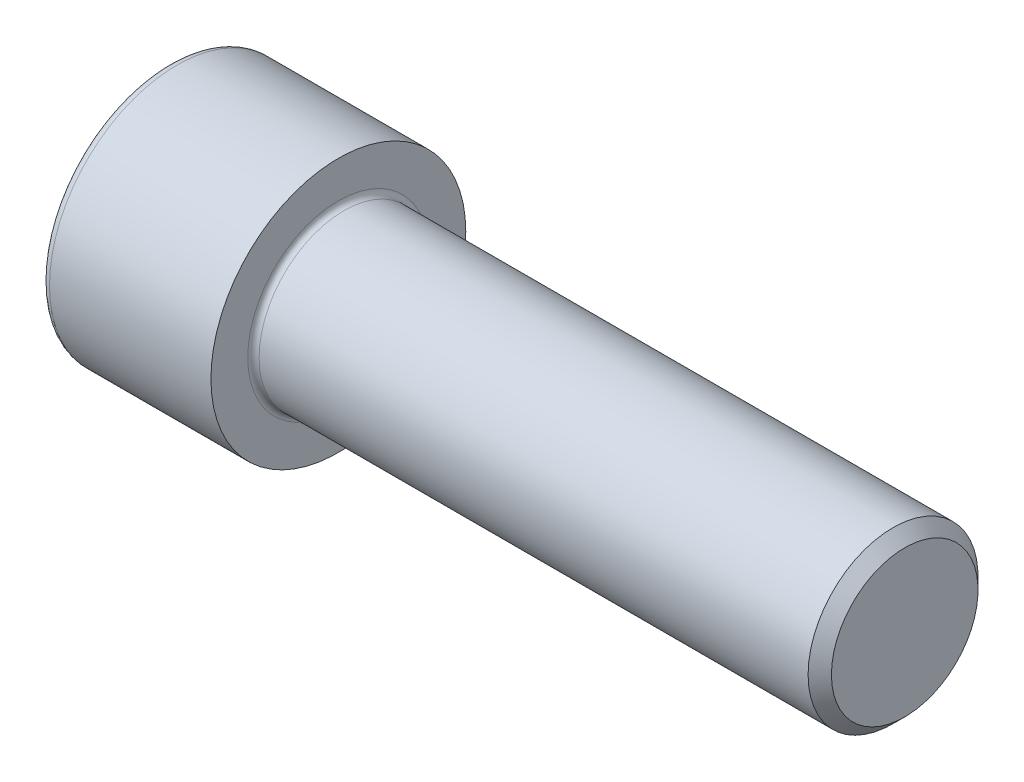
ISO-10303-21;
HEADER;
FILE_DESCRIPTION(('STEP AP214'),'2;1');
FILE_NAME('part.step','',(''),(''),'','','');
FILE_SCHEMA(('AUTOMOTIVE_DESIGN { 1 0 10303 214 1 1 1 1 }'));
ENDSEC;
DATA;
#1=APPLICATION_CONTEXT('core data for automotive mechanical design processes');
#2=APPLICATION_PROTOCOL_DEFINITION('international standard','automotive_design',2000,#1);
#3=PRODUCT_CONTEXT('',#1,'mechanical');
#4=PRODUCT('Part','Part','',(#3));
#5=PRODUCT_RELATED_PRODUCT_CATEGORY('part','',(#4));
#6=PRODUCT_DEFINITION_FORMATION('','',#4);
#7=PRODUCT_DEFINITION_CONTEXT('part definition',#1,'design');
#8=PRODUCT_DEFINITION('design','',#6,#7);
#9=PRODUCT_DEFINITION_SHAPE('','',#8);
#10=(LENGTH_UNIT() NAMED_UNIT(*) SI_UNIT(.MILLI.,.METRE.));
#11=(NAMED_UNIT(*) PLANE_ANGLE_UNIT() SI_UNIT($,.RADIAN.));
#12=(NAMED_UNIT(*) SI_UNIT($,.STERADIAN.) SOLID_ANGLE_UNIT());
#13=UNCERTAINTY_MEASURE_WITH_UNIT(LENGTH_MEASURE(1.E-05),#10,'distance_accuracy_value','');
#14=(GEOMETRIC_REPRESENTATION_CONTEXT(3) GLOBAL_UNCERTAINTY_ASSIGNED_CONTEXT((#13)) GLOBAL_UNIT_ASSIGNED_CONTEXT((#10,
#11,#12)) REPRESENTATION_CONTEXT('',''));
#15=CARTESIAN_POINT('',(0.,0.,0.));
#16=DIRECTION('',(0.,0.,1.));
#17=DIRECTION('',(1.,0.,0.));
#18=AXIS2_PLACEMENT_3D('',#15,#16,#17);
#19=CARTESIAN_POINT('',(0.,0.,0.));
#20=DIRECTION('',(-1.,0.,0.));
#21=DIRECTION('',(0.,0.,1.));
#22=AXIS2_PLACEMENT_3D('',#19,#20,#21);
#23=PLANE('',#22);
#24=DIRECTION('',(0.,-0.499999999999999,0.866025403784439));
#25=VECTOR('',#24,1.);
#26=CARTESIAN_POINT('',(0.,11.12842643863,0.));
#27=LINE('',#26,#25);
#28=CARTESIAN_POINT('',(0.,11.12842643863,0.));
#29=VERTEX_POINT('',#28);
#30=CARTESIAN_POINT('',(0.,5.56421321931503,9.63749999999999));
#31=VERTEX_POINT('',#30);
#32=EDGE_CURVE('E265',#29,#31,#27,.T.);
#33=ORIENTED_EDGE('',*,*,#32,.T.);
#34=DIRECTION('',(0.,1.,0.));
#35=VECTOR('',#34,1.);
#36=CARTESIAN_POINT('',(0.,-5.564213219315,9.6375));
#37=LINE('',#36,#35);
#38=CARTESIAN_POINT('',(0.,-5.564213219315,9.6375));
#39=VERTEX_POINT('',#38);
#40=EDGE_CURVE('E126',#39,#31,#37,.T.);
#41=ORIENTED_EDGE('',*,*,#40,.F.);
#42=DIRECTION('',(0.,-0.500000000000001,-0.866025403784438));
#43=VECTOR('',#42,1.);
#44=CARTESIAN_POINT('',(0.,-5.564213219315,9.6375));
#45=LINE('',#44,#43);
#46=CARTESIAN_POINT('',(0.,-11.12842643863,0.));
#47=VERTEX_POINT('',#46);
#48=EDGE_CURVE('E268',#39,#47,#45,.T.);
#49=ORIENTED_EDGE('',*,*,#48,.T.);
#50=DIRECTION('',(0.,0.499999999999999,-0.866025403784439));
#51=VECTOR('',#50,1.);
#52=CARTESIAN_POINT('',(0.,-11.12842643863,0.));
#53=LINE('',#52,#51);
#54=CARTESIAN_POINT('',(0.,-5.56421321931503,-9.63749999999999));
#55=VERTEX_POINT('',#54);
#56=EDGE_CURVE('E271',#47,#55,#53,.T.);
#57=ORIENTED_EDGE('',*,*,#56,.T.);
#58=DIRECTION('',(0.,-1.,0.));
#59=VECTOR('',#58,1.);
#60=CARTESIAN_POINT('',(0.,5.564213219315,-9.63750000000001));
#61=LINE('',#60,#59);
#62=CARTESIAN_POINT('',(0.,5.564213219315,-9.63750000000001));
#63=VERTEX_POINT('',#62);
#64=EDGE_CURVE('E274',#63,#55,#61,.T.);
#65=ORIENTED_EDGE('',*,*,#64,.F.);
#66=DIRECTION('',(0.,-0.500000000000001,-0.866025403784438));
#67=VECTOR('',#66,1.);
#68=CARTESIAN_POINT('',(0.,11.12842643863,0.));
#69=LINE('',#68,#67);
#70=EDGE_CURVE('E121',#29,#63,#69,.T.);
#71=ORIENTED_EDGE('',*,*,#70,.F.);
#72=EDGE_LOOP('',(#33,#41,#49,#57,#65,#71));
#73=FACE_BOUND('',#72,.T.);
#74=CARTESIAN_POINT('',(0.,0.,0.));
#75=DIRECTION('',(-1.,0.,0.));
#76=DIRECTION('',(0.,0.,1.));
#77=AXIS2_PLACEMENT_3D('',#74,#75,#76);
#78=CIRCLE('',#77,16.8);
#79=CARTESIAN_POINT('',(0.,0.,16.8));
#80=VERTEX_POINT('',#79);
#81=EDGE_CURVE('E42',#80,#80,#78,.T.);
#82=ORIENTED_EDGE('',*,*,#81,.T.);
#83=EDGE_LOOP('',(#82));
#84=FACE_BOUND('',#83,.T.);
#85=ADVANCED_FACE('F34',(#73,#84),#23,.T.);
#86=CARTESIAN_POINT('',(-31.75,0.,0.));
#87=DIRECTION('',(-1.,0.,0.));
#88=DIRECTION('',(0.,0.,1.));
#89=AXIS2_PLACEMENT_3D('',#86,#87,#88);
#90=CYLINDRICAL_SURFACE('',#89,18.);
#91=CARTESIAN_POINT('',(1.2,0.,0.));
#92=DIRECTION('',(-1.,0.,0.));
#93=DIRECTION('',(0.,0.,1.));
#94=AXIS2_PLACEMENT_3D('',#91,#92,#93);
#95=CIRCLE('',#94,18.);
#96=CARTESIAN_POINT('',(1.2,0.,18.));
#97=VERTEX_POINT('',#96);
#98=EDGE_CURVE('E11',#97,#97,#95,.F.);
#99=ORIENTED_EDGE('',*,*,#98,.T.);
#100=EDGE_LOOP('',(#99));
#101=FACE_BOUND('',#100,.T.);
#102=CARTESIAN_POINT('',(24.,0.,0.));
#103=DIRECTION('',(-1.,0.,0.));
#104=DIRECTION('',(0.,0.,1.));
#105=AXIS2_PLACEMENT_3D('',#102,#103,#104);
#106=CIRCLE('',#105,18.);
#107=CARTESIAN_POINT('',(24.,0.,18.));
#108=VERTEX_POINT('',#107);
#109=EDGE_CURVE('E144',#108,#108,#106,.T.);
#110=ORIENTED_EDGE('',*,*,#109,.T.);
#111=EDGE_LOOP('',(#110));
#112=FACE_BOUND('',#111,.T.);
#113=ADVANCED_FACE('F168',(#101,#112),#90,.T.);
#114=CARTESIAN_POINT('',(24.,18.,0.));
#115=DIRECTION('',(1.,0.,0.));
#116=DIRECTION('',(0.,0.,-1.));
#117=AXIS2_PLACEMENT_3D('',#114,#115,#116);
#118=PLANE('',#117);
#119=CARTESIAN_POINT('',(24.,0.,0.));
#120=DIRECTION('',(1.,0.,0.));
#121=DIRECTION('',(0.,0.,-1.));
#122=AXIS2_PLACEMENT_3D('',#119,#120,#121);
#123=CIRCLE('',#122,12.8);
#124=CARTESIAN_POINT('',(24.,0.,-12.8));
#125=VERTEX_POINT('',#124);
#126=EDGE_CURVE('E147',#125,#125,#123,.F.);
#127=ORIENTED_EDGE('',*,*,#126,.T.);
#128=EDGE_LOOP('',(#127));
#129=FACE_BOUND('',#128,.T.);
#130=ORIENTED_EDGE('',*,*,#109,.F.);
#131=EDGE_LOOP('',(#130));
#132=FACE_BOUND('',#131,.T.);
#133=ADVANCED_FACE('F174',(#129,#132),#118,.T.);
#134=CARTESIAN_POINT('',(-31.75,0.,0.));
#135=DIRECTION('',(-1.,0.,0.));
#136=DIRECTION('',(0.,0.,1.));
#137=AXIS2_PLACEMENT_3D('',#134,#135,#136);
#138=CYLINDRICAL_SURFACE('',#137,12.);
#139=CARTESIAN_POINT('',(24.8,0.,0.));
#140=DIRECTION('',(1.,0.,0.));
#141=DIRECTION('',(0.,0.,-1.));
#142=AXIS2_PLACEMENT_3D('',#139,#140,#141);
#143=CIRCLE('',#142,12.);
#144=CARTESIAN_POINT('',(24.8,0.,-12.));
#145=VERTEX_POINT('',#144);
#146=EDGE_CURVE('E150',#145,#145,#143,.T.);
#147=ORIENTED_EDGE('',*,*,#146,.T.);
#148=EDGE_LOOP('',(#147));
#149=FACE_BOUND('',#148,.T.);
#150=CARTESIAN_POINT('',(102.351999999998,0.,0.));
#151=DIRECTION('',(-1.,0.,0.));
#152=DIRECTION('',(0.,0.,1.));
#153=AXIS2_PLACEMENT_3D('',#150,#151,#152);
#154=CIRCLE('',#153,12.);
#155=CARTESIAN_POINT('',(102.351999999998,0.,12.));
#156=VERTEX_POINT('',#155);
#157=EDGE_CURVE('E141',#156,#156,#154,.T.);
#158=ORIENTED_EDGE('',*,*,#157,.T.);
#159=EDGE_LOOP('',(#158));
#160=FACE_BOUND('',#159,.T.);
#161=ADVANCED_FACE('F180',(#149,#160),#138,.T.);
#162=CARTESIAN_POINT('',(104.,0.,0.));
#163=DIRECTION('',(-1.,0.,0.));
#164=DIRECTION('',(0.,0.,1.));
#165=AXIS2_PLACEMENT_3D('',#162,#163,#164);
#166=CONICAL_SURFACE('',#165,10.352,0.785398163396898);
#167=ORIENTED_EDGE('',*,*,#157,.F.);
#168=EDGE_LOOP('',(#167));
#169=FACE_BOUND('',#168,.T.);
#170=CARTESIAN_POINT('',(104.,0.,0.));
#171=DIRECTION('',(-1.,0.,0.));
#172=DIRECTION('',(0.,0.,1.));
#173=AXIS2_PLACEMENT_3D('',#170,#171,#172);
#174=CIRCLE('',#173,10.352);
#175=CARTESIAN_POINT('',(104.,0.,10.352));
#176=VERTEX_POINT('',#175);
#177=EDGE_CURVE('E137',#176,#176,#174,.T.);
#178=ORIENTED_EDGE('',*,*,#177,.T.);
#179=EDGE_LOOP('',(#178));
#180=FACE_BOUND('',#179,.T.);
#181=ADVANCED_FACE('F184',(#169,#180),#166,.T.);
#182=CARTESIAN_POINT('',(104.,10.352,0.));
#183=DIRECTION('',(1.,0.,0.));
#184=DIRECTION('',(0.,0.,-1.));
#185=AXIS2_PLACEMENT_3D('',#182,#183,#184);
#186=PLANE('',#185);
#187=ORIENTED_EDGE('',*,*,#177,.F.);
#188=EDGE_LOOP('',(#187));
#189=FACE_BOUND('',#188,.T.);
#190=ADVANCED_FACE('F164',(#189),#186,.T.);
#191=CARTESIAN_POINT('',(24.8,0.,0.));
#192=DIRECTION('',(1.,0.,0.));
#193=DIRECTION('',(0.,0.,-1.));
#194=AXIS2_PLACEMENT_3D('',#191,#192,#193);
#195=TOROIDAL_SURFACE('',#194,12.8,0.8);
#196=ORIENTED_EDGE('',*,*,#146,.F.);
#197=EDGE_LOOP('',(#196));
#198=FACE_BOUND('',#197,.T.);
#199=ORIENTED_EDGE('',*,*,#126,.F.);
#200=EDGE_LOOP('',(#199));
#201=FACE_BOUND('',#200,.T.);
#202=ADVANCED_FACE('F157',(#198,#201),#195,.F.);
#203=CARTESIAN_POINT('',(1.2,0.,0.));
#204=DIRECTION('',(-1.,0.,0.));
#205=DIRECTION('',(0.,0.,1.));
#206=AXIS2_PLACEMENT_3D('',#203,#204,#205);
#207=TOROIDAL_SURFACE('',#206,16.8,1.2);
#208=ORIENTED_EDGE('',*,*,#98,.F.);
#209=EDGE_LOOP('',(#208));
#210=FACE_BOUND('',#209,.T.);
#211=ORIENTED_EDGE('',*,*,#81,.F.);
#212=EDGE_LOOP('',(#211));
#213=FACE_BOUND('',#212,.T.);
#214=ADVANCED_FACE('F36',(#210,#213),#207,.T.);
#215=CARTESIAN_POINT('',(12.573,11.12842643863,0.));
#216=DIRECTION('',(0.,-0.866025403784439,-0.499999999999999));
#217=DIRECTION('',(0.,0.499999999999999,-0.866025403784439));
#218=AXIS2_PLACEMENT_3D('',#215,#216,#217);
#219=PLANE('',#218);
#220=ORIENTED_EDGE('',*,*,#32,.F.);
#221=DIRECTION('',(-1.,0.,0.));
#222=VECTOR('',#221,1.);
#223=CARTESIAN_POINT('',(12.573,11.12842643863,0.));
#224=LINE('',#223,#222);
#225=CARTESIAN_POINT('',(12.573,11.12842643863,0.));
#226=VERTEX_POINT('',#225);
#227=EDGE_CURVE('E264',#226,#29,#224,.T.);
#228=ORIENTED_EDGE('',*,*,#227,.F.);
#229=DIRECTION('',(0.,-0.499999999999999,0.866025403784439));
#230=VECTOR('',#229,1.);
#231=CARTESIAN_POINT('',(12.573,11.12842643863,0.));
#232=LINE('',#231,#230);
#233=CARTESIAN_POINT('',(12.573,8.34631982897253,4.81874999999999));
#234=VERTEX_POINT('',#233);
#235=EDGE_CURVE('E49',#226,#234,#232,.T.);
#236=ORIENTED_EDGE('',*,*,#235,.T.);
#237=CARTESIAN_POINT('',(12.573,5.56421321931503,9.63749999999999));
#238=VERTEX_POINT('',#237);
#239=EDGE_CURVE('E107',#234,#238,#232,.T.);
#240=ORIENTED_EDGE('',*,*,#239,.T.);
#241=DIRECTION('',(-1.,0.,0.));
#242=VECTOR('',#241,1.);
#243=CARTESIAN_POINT('',(12.573,5.56421321931503,9.63749999999999));
#244=LINE('',#243,#242);
#245=EDGE_CURVE('E119',#238,#31,#244,.T.);
#246=ORIENTED_EDGE('',*,*,#245,.T.);
#247=EDGE_LOOP('',(#220,#228,#236,#240,#246));
#248=FACE_BOUND('',#247,.T.);
#249=ADVANCED_FACE('F118',(#248),#219,.T.);
#250=CARTESIAN_POINT('',(12.573,-5.564213219315,9.6375));
#251=DIRECTION('',(0.,0.,1.));
#252=DIRECTION('',(0.,-1.,0.));
#253=AXIS2_PLACEMENT_3D('',#250,#251,#252);
#254=PLANE('',#253);
#255=ORIENTED_EDGE('',*,*,#40,.T.);
#256=ORIENTED_EDGE('',*,*,#245,.F.);
#257=DIRECTION('',(0.,1.,0.));
#258=VECTOR('',#257,1.);
#259=CARTESIAN_POINT('',(12.573,-5.564213219315,9.6375));
#260=LINE('',#259,#258);
#261=CARTESIAN_POINT('',(12.573,0.,9.6375));
#262=VERTEX_POINT('',#261);
#263=EDGE_CURVE('E105',#262,#238,#260,.T.);
#264=ORIENTED_EDGE('',*,*,#263,.F.);
#265=CARTESIAN_POINT('',(12.573,-5.564213219315,9.6375));
#266=VERTEX_POINT('',#265);
#267=EDGE_CURVE('E115',#266,#262,#260,.T.);
#268=ORIENTED_EDGE('',*,*,#267,.F.);
#269=DIRECTION('',(-1.,0.,0.));
#270=VECTOR('',#269,1.);
#271=CARTESIAN_POINT('',(12.573,-5.564213219315,9.6375));
#272=LINE('',#271,#270);
#273=EDGE_CURVE('E128',#266,#39,#272,.T.);
#274=ORIENTED_EDGE('',*,*,#273,.T.);
#275=EDGE_LOOP('',(#255,#256,#264,#268,#274));
#276=FACE_BOUND('',#275,.T.);
#277=ADVANCED_FACE('F123',(#276),#254,.F.);
#278=CARTESIAN_POINT('',(12.573,-5.564213219315,9.6375));
#279=DIRECTION('',(0.,0.866025403784438,-0.500000000000001));
#280=DIRECTION('',(0.,0.500000000000001,0.866025403784438));
#281=AXIS2_PLACEMENT_3D('',#278,#279,#280);
#282=PLANE('',#281);
#283=ORIENTED_EDGE('',*,*,#48,.F.);
#284=ORIENTED_EDGE('',*,*,#273,.F.);
#285=DIRECTION('',(0.,-0.500000000000001,-0.866025403784438));
#286=VECTOR('',#285,1.);
#287=CARTESIAN_POINT('',(12.573,-5.564213219315,9.6375));
#288=LINE('',#287,#286);
#289=CARTESIAN_POINT('',(12.573,-8.34631982897252,4.81875));
#290=VERTEX_POINT('',#289);
#291=EDGE_CURVE('E245',#266,#290,#288,.T.);
#292=ORIENTED_EDGE('',*,*,#291,.T.);
#293=CARTESIAN_POINT('',(12.573,-11.12842643863,0.));
#294=VERTEX_POINT('',#293);
#295=EDGE_CURVE('E247',#290,#294,#288,.T.);
#296=ORIENTED_EDGE('',*,*,#295,.T.);
#297=DIRECTION('',(-1.,0.,0.));
#298=VECTOR('',#297,1.);
#299=CARTESIAN_POINT('',(12.573,-11.12842643863,0.));
#300=LINE('',#299,#298);
#301=EDGE_CURVE('E133',#294,#47,#300,.T.);
#302=ORIENTED_EDGE('',*,*,#301,.T.);
#303=EDGE_LOOP('',(#283,#284,#292,#296,#302));
#304=FACE_BOUND('',#303,.T.);
#305=ADVANCED_FACE('F197',(#304),#282,.T.);
#306=CARTESIAN_POINT('',(12.573,-11.12842643863,0.));
#307=DIRECTION('',(0.,0.86602540378444,0.499999999999999));
#308=DIRECTION('',(0.,-0.499999999999999,0.86602540378444));
#309=AXIS2_PLACEMENT_3D('',#306,#307,#308);
#310=PLANE('',#309);
#311=ORIENTED_EDGE('',*,*,#56,.F.);
#312=ORIENTED_EDGE('',*,*,#301,.F.);
#313=DIRECTION('',(0.,0.499999999999999,-0.866025403784439));
#314=VECTOR('',#313,1.);
#315=CARTESIAN_POINT('',(12.573,-11.12842643863,0.));
#316=LINE('',#315,#314);
#317=CARTESIAN_POINT('',(12.573,-8.34631982897254,-4.81874999999999));
#318=VERTEX_POINT('',#317);
#319=EDGE_CURVE('E250',#294,#318,#316,.T.);
#320=ORIENTED_EDGE('',*,*,#319,.T.);
#321=CARTESIAN_POINT('',(12.573,-5.56421321931503,-9.63749999999999));
#322=VERTEX_POINT('',#321);
#323=EDGE_CURVE('E254',#318,#322,#316,.T.);
#324=ORIENTED_EDGE('',*,*,#323,.T.);
#325=DIRECTION('',(-1.,0.,0.));
#326=VECTOR('',#325,1.);
#327=CARTESIAN_POINT('',(12.573,-5.56421321931503,-9.63749999999999));
#328=LINE('',#327,#326);
#329=EDGE_CURVE('E283',#322,#55,#328,.T.);
#330=ORIENTED_EDGE('',*,*,#329,.T.);
#331=EDGE_LOOP('',(#311,#312,#320,#324,#330));
#332=FACE_BOUND('',#331,.T.);
#333=ADVANCED_FACE('F200',(#332),#310,.T.);
#334=CARTESIAN_POINT('',(12.573,5.564213219315,-9.63750000000001));
#335=DIRECTION('',(0.,0.,-1.));
#336=DIRECTION('',(0.,1.,0.));
#337=AXIS2_PLACEMENT_3D('',#334,#335,#336);
#338=PLANE('',#337);
#339=ORIENTED_EDGE('',*,*,#64,.T.);
#340=ORIENTED_EDGE('',*,*,#329,.F.);
#341=DIRECTION('',(0.,-1.,0.));
#342=VECTOR('',#341,1.);
#343=CARTESIAN_POINT('',(12.573,5.564213219315,-9.63750000000001));
#344=LINE('',#343,#342);
#345=CARTESIAN_POINT('',(12.573,0.,-9.6375));
#346=VERTEX_POINT('',#345);
#347=EDGE_CURVE('E258',#346,#322,#344,.T.);
#348=ORIENTED_EDGE('',*,*,#347,.F.);
#349=CARTESIAN_POINT('',(12.573,5.564213219315,-9.63750000000001));
#350=VERTEX_POINT('',#349);
#351=EDGE_CURVE('E259',#350,#346,#344,.T.);
#352=ORIENTED_EDGE('',*,*,#351,.F.);
#353=DIRECTION('',(-1.,0.,0.));
#354=VECTOR('',#353,1.);
#355=CARTESIAN_POINT('',(12.573,5.564213219315,-9.63750000000001));
#356=LINE('',#355,#354);
#357=EDGE_CURVE('E280',#350,#63,#356,.T.);
#358=ORIENTED_EDGE('',*,*,#357,.T.);
#359=EDGE_LOOP('',(#339,#340,#348,#352,#358));
#360=FACE_BOUND('',#359,.T.);
#361=ADVANCED_FACE('F204',(#360),#338,.F.);
#362=CARTESIAN_POINT('',(12.573,11.12842643863,0.));
#363=DIRECTION('',(0.,0.866025403784438,-0.500000000000001));
#364=DIRECTION('',(0.,0.500000000000001,0.866025403784438));
#365=AXIS2_PLACEMENT_3D('',#362,#363,#364);
#366=PLANE('',#365);
#367=ORIENTED_EDGE('',*,*,#70,.T.);
#368=ORIENTED_EDGE('',*,*,#357,.F.);
#369=DIRECTION('',(0.,-0.500000000000001,-0.866025403784438));
#370=VECTOR('',#369,1.);
#371=CARTESIAN_POINT('',(12.573,11.12842643863,0.));
#372=LINE('',#371,#370);
#373=CARTESIAN_POINT('',(12.573,8.34631982897252,-4.81875000000001));
#374=VERTEX_POINT('',#373);
#375=EDGE_CURVE('E262',#374,#350,#372,.T.);
#376=ORIENTED_EDGE('',*,*,#375,.F.);
#377=EDGE_CURVE('E236',#226,#374,#372,.T.);
#378=ORIENTED_EDGE('',*,*,#377,.F.);
#379=ORIENTED_EDGE('',*,*,#227,.T.);
#380=EDGE_LOOP('',(#367,#368,#376,#378,#379));
#381=FACE_BOUND('',#380,.T.);
#382=ADVANCED_FACE('F208',(#381),#366,.F.);
#383=CARTESIAN_POINT('',(12.573,5.56421321931503,9.63749999999999));
#384=DIRECTION('',(-1.,0.,0.));
#385=DIRECTION('',(0.,0.,1.));
#386=AXIS2_PLACEMENT_3D('',#383,#384,#385);
#387=PLANE('',#386);
#388=CARTESIAN_POINT('',(12.573,0.,0.));
#389=DIRECTION('',(-1.,0.,0.));
#390=DIRECTION('',(0.,0.,1.));
#391=AXIS2_PLACEMENT_3D('',#388,#389,#390);
#392=CIRCLE('',#391,9.6375);
#393=EDGE_CURVE('E127',#290,#262,#392,.T.);
#394=ORIENTED_EDGE('',*,*,#393,.F.);
#395=ORIENTED_EDGE('',*,*,#291,.F.);
#396=ORIENTED_EDGE('',*,*,#267,.T.);
#397=EDGE_LOOP('',(#394,#395,#396));
#398=FACE_BOUND('',#397,.T.);
#399=ADVANCED_FACE('F212',(#398),#387,.T.);
#400=EDGE_CURVE('E131',#318,#290,#392,.T.);
#401=ORIENTED_EDGE('',*,*,#400,.F.);
#402=ORIENTED_EDGE('',*,*,#319,.F.);
#403=ORIENTED_EDGE('',*,*,#295,.F.);
#404=EDGE_LOOP('',(#401,#402,#403));
#405=FACE_BOUND('',#404,.T.);
#406=ADVANCED_FACE('F215',(#405),#387,.T.);
#407=EDGE_CURVE('E289',#346,#318,#392,.T.);
#408=ORIENTED_EDGE('',*,*,#407,.F.);
#409=ORIENTED_EDGE('',*,*,#347,.T.);
#410=ORIENTED_EDGE('',*,*,#323,.F.);
#411=EDGE_LOOP('',(#408,#409,#410));
#412=FACE_BOUND('',#411,.T.);
#413=ADVANCED_FACE('F220',(#412),#387,.T.);
#414=EDGE_CURVE('E239',#374,#346,#392,.T.);
#415=ORIENTED_EDGE('',*,*,#414,.F.);
#416=ORIENTED_EDGE('',*,*,#375,.T.);
#417=ORIENTED_EDGE('',*,*,#351,.T.);
#418=EDGE_LOOP('',(#415,#416,#417));
#419=FACE_BOUND('',#418,.T.);
#420=ADVANCED_FACE('F227',(#419),#387,.T.);
#421=EDGE_CURVE('E138',#234,#374,#392,.T.);
#422=ORIENTED_EDGE('',*,*,#421,.F.);
#423=ORIENTED_EDGE('',*,*,#235,.F.);
#424=ORIENTED_EDGE('',*,*,#377,.T.);
#425=EDGE_LOOP('',(#422,#423,#424));
#426=FACE_BOUND('',#425,.T.);
#427=ADVANCED_FACE('F223',(#426),#387,.T.);
#428=EDGE_CURVE('E110',#262,#234,#392,.T.);
#429=ORIENTED_EDGE('',*,*,#428,.F.);
#430=ORIENTED_EDGE('',*,*,#263,.T.);
#431=ORIENTED_EDGE('',*,*,#239,.F.);
#432=EDGE_LOOP('',(#429,#430,#431));
#433=FACE_BOUND('',#432,.T.);
#434=ADVANCED_FACE('F106',(#433),#387,.T.);
#435=CARTESIAN_POINT('',(12.573,0.,0.));
#436=DIRECTION('',(-1.,0.,0.));
#437=DIRECTION('',(0.,0.,1.));
#438=AXIS2_PLACEMENT_3D('',#435,#436,#437);
#439=CONICAL_SURFACE('',#438,9.6375,1.04719755119659);
#440=CARTESIAN_POINT('',(18.1372132193151,0.,0.));
#441=VERTEX_POINT('',#440);
#442=VERTEX_LOOP('',#441);
#443=FACE_BOUND('',#442,.T.);
#444=ORIENTED_EDGE('',*,*,#428,.T.);
#445=ORIENTED_EDGE('',*,*,#421,.T.);
#446=ORIENTED_EDGE('',*,*,#414,.T.);
#447=ORIENTED_EDGE('',*,*,#407,.T.);
#448=ORIENTED_EDGE('',*,*,#400,.T.);
#449=ORIENTED_EDGE('',*,*,#393,.T.);
#450=EDGE_LOOP('',(#444,#445,#446,#447,#448,#449));
#451=FACE_BOUND('',#450,.T.);
#452=ADVANCED_FACE('F192',(#443,#451),#439,.F.);
#453=CLOSED_SHELL('',(#85,#113,#133,#161,#181,#190,#202,#214,#249,#277,#305,#333,#361,#382,#399,
#406,#413,#420,#427,#434,#452));
#454=MANIFOLD_SOLID_BREP('B2',#453);
#455=ADVANCED_BREP_SHAPE_REPRESENTATION('',(#18,#454),#14);
#456=SHAPE_DEFINITION_REPRESENTATION(#9,#455);
ENDSEC;
END-ISO-10303-21;
